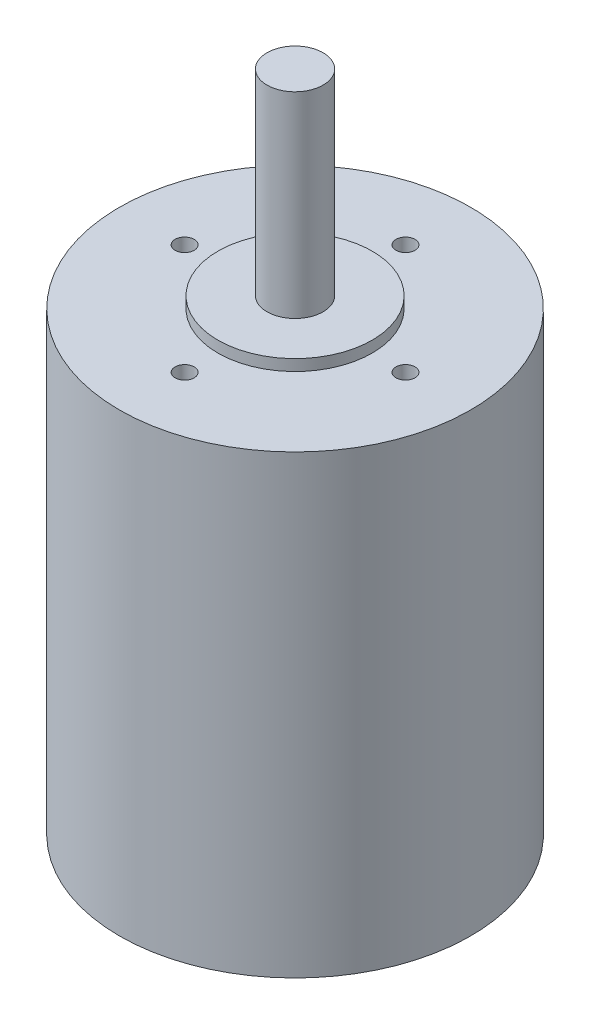
ISO-10303-21;
HEADER;
FILE_DESCRIPTION(('STEP AP214'),'2;1');
FILE_NAME('part.step','',(''),(''),'','','');
FILE_SCHEMA(('AUTOMOTIVE_DESIGN { 1 0 10303 214 1 1 1 1 }'));
ENDSEC;
DATA;
#1=APPLICATION_CONTEXT('core data for automotive mechanical design processes');
#2=APPLICATION_PROTOCOL_DEFINITION('international standard','automotive_design',2000,#1);
#3=PRODUCT_CONTEXT('',#1,'mechanical');
#4=PRODUCT('Part','Part','',(#3));
#5=PRODUCT_RELATED_PRODUCT_CATEGORY('part','',(#4));
#6=PRODUCT_DEFINITION_FORMATION('','',#4);
#7=PRODUCT_DEFINITION_CONTEXT('part definition',#1,'design');
#8=PRODUCT_DEFINITION('design','',#6,#7);
#9=PRODUCT_DEFINITION_SHAPE('','',#8);
#10=(LENGTH_UNIT() NAMED_UNIT(*) SI_UNIT(.MILLI.,.METRE.));
#11=(NAMED_UNIT(*) PLANE_ANGLE_UNIT() SI_UNIT($,.RADIAN.));
#12=(NAMED_UNIT(*) SI_UNIT($,.STERADIAN.) SOLID_ANGLE_UNIT());
#13=UNCERTAINTY_MEASURE_WITH_UNIT(LENGTH_MEASURE(1.E-05),#10,'distance_accuracy_value','');
#14=(GEOMETRIC_REPRESENTATION_CONTEXT(3) GLOBAL_UNCERTAINTY_ASSIGNED_CONTEXT((#13)) GLOBAL_UNIT_ASSIGNED_CONTEXT((#10,
#11,#12)) REPRESENTATION_CONTEXT('',''));
#15=CARTESIAN_POINT('',(0.,0.,0.));
#16=DIRECTION('',(0.,0.,1.));
#17=DIRECTION('',(1.,0.,0.));
#18=AXIS2_PLACEMENT_3D('',#15,#16,#17);
#19=CARTESIAN_POINT('',(0.,105.664,0.));
#20=DIRECTION('',(0.,1.,0.));
#21=DIRECTION('',(0.,0.,1.));
#22=AXIS2_PLACEMENT_3D('',#19,#20,#21);
#23=PLANE('',#22);
#24=CARTESIAN_POINT('',(0.,105.664,0.));
#25=DIRECTION('',(0.,1.,0.));
#26=DIRECTION('',(0.,0.,1.));
#27=AXIS2_PLACEMENT_3D('',#24,#25,#26);
#28=CIRCLE('',#27,17.4625);
#29=CARTESIAN_POINT('',(0.,105.664,17.4625));
#30=VERTEX_POINT('',#29);
#31=EDGE_CURVE('E42',#30,#30,#28,.T.);
#32=ORIENTED_EDGE('',*,*,#31,.T.);
#33=EDGE_LOOP('',(#32));
#34=FACE_BOUND('',#33,.T.);
#35=CARTESIAN_POINT('',(0.,105.664,0.));
#36=DIRECTION('',(0.,1.,0.));
#37=DIRECTION('',(0.,0.,1.));
#38=AXIS2_PLACEMENT_3D('',#35,#36,#37);
#39=CIRCLE('',#38,6.35);
#40=CARTESIAN_POINT('',(0.,105.664,6.35));
#41=VERTEX_POINT('',#40);
#42=EDGE_CURVE('E50',#41,#41,#39,.T.);
#43=ORIENTED_EDGE('',*,*,#42,.F.);
#44=EDGE_LOOP('',(#43));
#45=FACE_BOUND('',#44,.T.);
#46=ADVANCED_FACE('F31',(#34,#45),#23,.T.);
#47=CARTESIAN_POINT('',(0.,103.124,0.));
#48=DIRECTION('',(0.,1.,0.));
#49=DIRECTION('',(0.,0.,1.));
#50=AXIS2_PLACEMENT_3D('',#47,#48,#49);
#51=PLANE('',#50);
#52=CARTESIAN_POINT('',(-25.,103.124,0.));
#53=DIRECTION('',(0.,1.,0.));
#54=DIRECTION('',(0.,0.,1.));
#55=AXIS2_PLACEMENT_3D('',#52,#53,#54);
#56=CIRCLE('',#55,2.159);
#57=CARTESIAN_POINT('',(-25.,103.124,2.159));
#58=VERTEX_POINT('',#57);
#59=EDGE_CURVE('E74',#58,#58,#56,.T.);
#60=ORIENTED_EDGE('',*,*,#59,.F.);
#61=EDGE_LOOP('',(#60));
#62=FACE_BOUND('',#61,.T.);
#63=CARTESIAN_POINT('',(0.,103.124,25.));
#64=DIRECTION('',(0.,1.,0.));
#65=DIRECTION('',(0.,0.,1.));
#66=AXIS2_PLACEMENT_3D('',#63,#64,#65);
#67=CIRCLE('',#66,2.159);
#68=CARTESIAN_POINT('',(0.,103.124,27.159));
#69=VERTEX_POINT('',#68);
#70=EDGE_CURVE('E68',#69,#69,#67,.T.);
#71=ORIENTED_EDGE('',*,*,#70,.F.);
#72=EDGE_LOOP('',(#71));
#73=FACE_BOUND('',#72,.T.);
#74=CARTESIAN_POINT('',(25.,103.124,0.));
#75=DIRECTION('',(0.,1.,0.));
#76=DIRECTION('',(0.,0.,1.));
#77=AXIS2_PLACEMENT_3D('',#74,#75,#76);
#78=CIRCLE('',#77,2.159);
#79=CARTESIAN_POINT('',(25.,103.124,2.159));
#80=VERTEX_POINT('',#79);
#81=EDGE_CURVE('E62',#80,#80,#78,.T.);
#82=ORIENTED_EDGE('',*,*,#81,.F.);
#83=EDGE_LOOP('',(#82));
#84=FACE_BOUND('',#83,.T.);
#85=CARTESIAN_POINT('',(0.,103.124,-25.));
#86=DIRECTION('',(0.,1.,0.));
#87=DIRECTION('',(0.,0.,1.));
#88=AXIS2_PLACEMENT_3D('',#85,#86,#87);
#89=CIRCLE('',#88,2.159);
#90=CARTESIAN_POINT('',(0.,103.124,-22.841));
#91=VERTEX_POINT('',#90);
#92=EDGE_CURVE('E56',#91,#91,#89,.T.);
#93=ORIENTED_EDGE('',*,*,#92,.F.);
#94=EDGE_LOOP('',(#93));
#95=FACE_BOUND('',#94,.T.);
#96=CARTESIAN_POINT('',(0.,103.124,0.));
#97=DIRECTION('',(0.,1.,0.));
#98=DIRECTION('',(0.,0.,1.));
#99=AXIS2_PLACEMENT_3D('',#96,#97,#98);
#100=CIRCLE('',#99,39.751);
#101=CARTESIAN_POINT('',(0.,103.124,39.751));
#102=VERTEX_POINT('',#101);
#103=EDGE_CURVE('E10',#102,#102,#100,.T.);
#104=ORIENTED_EDGE('',*,*,#103,.T.);
#105=EDGE_LOOP('',(#104));
#106=FACE_BOUND('',#105,.T.);
#107=CARTESIAN_POINT('',(0.,103.124,0.));
#108=DIRECTION('',(0.,1.,0.));
#109=DIRECTION('',(0.,0.,1.));
#110=AXIS2_PLACEMENT_3D('',#107,#108,#109);
#111=CIRCLE('',#110,17.4625);
#112=CARTESIAN_POINT('',(0.,103.124,17.4625));
#113=VERTEX_POINT('',#112);
#114=EDGE_CURVE('E44',#113,#113,#111,.T.);
#115=ORIENTED_EDGE('',*,*,#114,.F.);
#116=EDGE_LOOP('',(#115));
#117=FACE_BOUND('',#116,.T.);
#118=ADVANCED_FACE('F89',(#62,#73,#84,#95,#106,#117),#51,.T.);
#119=CARTESIAN_POINT('',(0.,103.124,0.));
#120=DIRECTION('',(0.,-1.,0.));
#121=DIRECTION('',(0.,0.,-1.));
#122=AXIS2_PLACEMENT_3D('',#119,#120,#121);
#123=CYLINDRICAL_SURFACE('',#122,39.751);
#124=ORIENTED_EDGE('',*,*,#103,.F.);
#125=EDGE_LOOP('',(#124));
#126=FACE_BOUND('',#125,.T.);
#127=CARTESIAN_POINT('',(0.,0.,0.));
#128=DIRECTION('',(0.,1.,0.));
#129=DIRECTION('',(0.,0.,1.));
#130=AXIS2_PLACEMENT_3D('',#127,#128,#129);
#131=CIRCLE('',#130,39.751);
#132=CARTESIAN_POINT('',(0.,0.,39.751));
#133=VERTEX_POINT('',#132);
#134=EDGE_CURVE('E35',#133,#133,#131,.T.);
#135=ORIENTED_EDGE('',*,*,#134,.T.);
#136=EDGE_LOOP('',(#135));
#137=FACE_BOUND('',#136,.T.);
#138=ADVANCED_FACE('F33',(#126,#137),#123,.T.);
#139=CARTESIAN_POINT('',(0.,0.,0.));
#140=DIRECTION('',(0.,1.,0.));
#141=DIRECTION('',(0.,0.,1.));
#142=AXIS2_PLACEMENT_3D('',#139,#140,#141);
#143=PLANE('',#142);
#144=ORIENTED_EDGE('',*,*,#134,.F.);
#145=EDGE_LOOP('',(#144));
#146=FACE_BOUND('',#145,.T.);
#147=ADVANCED_FACE('F104',(#146),#143,.F.);
#148=CARTESIAN_POINT('',(0.,105.664,0.));
#149=DIRECTION('',(0.,-1.,0.));
#150=DIRECTION('',(0.,0.,-1.));
#151=AXIS2_PLACEMENT_3D('',#148,#149,#150);
#152=CYLINDRICAL_SURFACE('',#151,17.4625);
#153=ORIENTED_EDGE('',*,*,#31,.F.);
#154=EDGE_LOOP('',(#153));
#155=FACE_BOUND('',#154,.T.);
#156=ORIENTED_EDGE('',*,*,#114,.T.);
#157=EDGE_LOOP('',(#156));
#158=FACE_BOUND('',#157,.T.);
#159=ADVANCED_FACE('F101',(#155,#158),#152,.T.);
#160=CARTESIAN_POINT('',(0.,150.114,0.));
#161=DIRECTION('',(0.,-1.,0.));
#162=DIRECTION('',(0.,0.,-1.));
#163=AXIS2_PLACEMENT_3D('',#160,#161,#162);
#164=CYLINDRICAL_SURFACE('',#163,6.35);
#165=CARTESIAN_POINT('',(0.,150.114,0.));
#166=DIRECTION('',(0.,1.,0.));
#167=DIRECTION('',(0.,0.,1.));
#168=AXIS2_PLACEMENT_3D('',#165,#166,#167);
#169=CIRCLE('',#168,6.35);
#170=CARTESIAN_POINT('',(0.,150.114,6.35));
#171=VERTEX_POINT('',#170);
#172=EDGE_CURVE('E47',#171,#171,#169,.T.);
#173=ORIENTED_EDGE('',*,*,#172,.F.);
#174=EDGE_LOOP('',(#173));
#175=FACE_BOUND('',#174,.T.);
#176=ORIENTED_EDGE('',*,*,#42,.T.);
#177=EDGE_LOOP('',(#176));
#178=FACE_BOUND('',#177,.T.);
#179=ADVANCED_FACE('F103',(#175,#178),#164,.T.);
#180=CARTESIAN_POINT('',(0.,150.114,0.));
#181=DIRECTION('',(0.,1.,0.));
#182=DIRECTION('',(0.,0.,1.));
#183=AXIS2_PLACEMENT_3D('',#180,#181,#182);
#184=PLANE('',#183);
#185=ORIENTED_EDGE('',*,*,#172,.T.);
#186=EDGE_LOOP('',(#185));
#187=FACE_BOUND('',#186,.T.);
#188=ADVANCED_FACE('F111',(#187),#184,.T.);
#189=CARTESIAN_POINT('',(0.,58.674,-25.));
#190=DIRECTION('',(0.,1.,0.));
#191=DIRECTION('',(0.,0.,1.));
#192=AXIS2_PLACEMENT_3D('',#189,#190,#191);
#193=CYLINDRICAL_SURFACE('',#192,2.159);
#194=CARTESIAN_POINT('',(0.,58.674,-25.));
#195=DIRECTION('',(0.,1.,0.));
#196=DIRECTION('',(0.,0.,1.));
#197=AXIS2_PLACEMENT_3D('',#194,#195,#196);
#198=CIRCLE('',#197,2.159);
#199=CARTESIAN_POINT('',(0.,58.674,-22.841));
#200=VERTEX_POINT('',#199);
#201=EDGE_CURVE('E53',#200,#200,#198,.T.);
#202=ORIENTED_EDGE('',*,*,#201,.F.);
#203=EDGE_LOOP('',(#202));
#204=FACE_BOUND('',#203,.T.);
#205=ORIENTED_EDGE('',*,*,#92,.T.);
#206=EDGE_LOOP('',(#205));
#207=FACE_BOUND('',#206,.T.);
#208=ADVANCED_FACE('F125',(#204,#207),#193,.F.);
#209=CARTESIAN_POINT('',(0.,58.674,-25.));
#210=DIRECTION('',(0.,1.,0.));
#211=DIRECTION('',(0.,0.,1.));
#212=AXIS2_PLACEMENT_3D('',#209,#210,#211);
#213=PLANE('',#212);
#214=ORIENTED_EDGE('',*,*,#201,.T.);
#215=EDGE_LOOP('',(#214));
#216=FACE_BOUND('',#215,.T.);
#217=ADVANCED_FACE('F129',(#216),#213,.T.);
#218=CARTESIAN_POINT('',(25.,58.674,0.));
#219=DIRECTION('',(0.,1.,0.));
#220=DIRECTION('',(0.,0.,1.));
#221=AXIS2_PLACEMENT_3D('',#218,#219,#220);
#222=CYLINDRICAL_SURFACE('',#221,2.159);
#223=CARTESIAN_POINT('',(25.,58.674,0.));
#224=DIRECTION('',(0.,1.,0.));
#225=DIRECTION('',(0.,0.,1.));
#226=AXIS2_PLACEMENT_3D('',#223,#224,#225);
#227=CIRCLE('',#226,2.159);
#228=CARTESIAN_POINT('',(25.,58.674,2.159));
#229=VERTEX_POINT('',#228);
#230=EDGE_CURVE('E59',#229,#229,#227,.T.);
#231=ORIENTED_EDGE('',*,*,#230,.F.);
#232=EDGE_LOOP('',(#231));
#233=FACE_BOUND('',#232,.T.);
#234=ORIENTED_EDGE('',*,*,#81,.T.);
#235=EDGE_LOOP('',(#234));
#236=FACE_BOUND('',#235,.T.);
#237=ADVANCED_FACE('F133',(#233,#236),#222,.F.);
#238=CARTESIAN_POINT('',(25.,58.674,0.));
#239=DIRECTION('',(0.,1.,0.));
#240=DIRECTION('',(0.,0.,1.));
#241=AXIS2_PLACEMENT_3D('',#238,#239,#240);
#242=PLANE('',#241);
#243=ORIENTED_EDGE('',*,*,#230,.T.);
#244=EDGE_LOOP('',(#243));
#245=FACE_BOUND('',#244,.T.);
#246=ADVANCED_FACE('F137',(#245),#242,.T.);
#247=CARTESIAN_POINT('',(0.,58.674,25.));
#248=DIRECTION('',(0.,1.,0.));
#249=DIRECTION('',(0.,0.,1.));
#250=AXIS2_PLACEMENT_3D('',#247,#248,#249);
#251=CYLINDRICAL_SURFACE('',#250,2.159);
#252=CARTESIAN_POINT('',(0.,58.674,25.));
#253=DIRECTION('',(0.,1.,0.));
#254=DIRECTION('',(0.,0.,1.));
#255=AXIS2_PLACEMENT_3D('',#252,#253,#254);
#256=CIRCLE('',#255,2.159);
#257=CARTESIAN_POINT('',(0.,58.674,27.159));
#258=VERTEX_POINT('',#257);
#259=EDGE_CURVE('E65',#258,#258,#256,.T.);
#260=ORIENTED_EDGE('',*,*,#259,.F.);
#261=EDGE_LOOP('',(#260));
#262=FACE_BOUND('',#261,.T.);
#263=ORIENTED_EDGE('',*,*,#70,.T.);
#264=EDGE_LOOP('',(#263));
#265=FACE_BOUND('',#264,.T.);
#266=ADVANCED_FACE('F141',(#262,#265),#251,.F.);
#267=CARTESIAN_POINT('',(0.,58.674,25.));
#268=DIRECTION('',(0.,1.,0.));
#269=DIRECTION('',(0.,0.,1.));
#270=AXIS2_PLACEMENT_3D('',#267,#268,#269);
#271=PLANE('',#270);
#272=ORIENTED_EDGE('',*,*,#259,.T.);
#273=EDGE_LOOP('',(#272));
#274=FACE_BOUND('',#273,.T.);
#275=ADVANCED_FACE('F85',(#274),#271,.T.);
#276=CARTESIAN_POINT('',(-25.,58.674,0.));
#277=DIRECTION('',(0.,1.,0.));
#278=DIRECTION('',(0.,0.,1.));
#279=AXIS2_PLACEMENT_3D('',#276,#277,#278);
#280=CYLINDRICAL_SURFACE('',#279,2.159);
#281=CARTESIAN_POINT('',(-25.,58.674,0.));
#282=DIRECTION('',(0.,1.,0.));
#283=DIRECTION('',(0.,0.,1.));
#284=AXIS2_PLACEMENT_3D('',#281,#282,#283);
#285=CIRCLE('',#284,2.159);
#286=CARTESIAN_POINT('',(-25.,58.674,2.159));
#287=VERTEX_POINT('',#286);
#288=EDGE_CURVE('E71',#287,#287,#285,.T.);
#289=ORIENTED_EDGE('',*,*,#288,.F.);
#290=EDGE_LOOP('',(#289));
#291=FACE_BOUND('',#290,.T.);
#292=ORIENTED_EDGE('',*,*,#59,.T.);
#293=EDGE_LOOP('',(#292));
#294=FACE_BOUND('',#293,.T.);
#295=ADVANCED_FACE('F82',(#291,#294),#280,.F.);
#296=CARTESIAN_POINT('',(-25.,58.674,0.));
#297=DIRECTION('',(0.,1.,0.));
#298=DIRECTION('',(0.,0.,1.));
#299=AXIS2_PLACEMENT_3D('',#296,#297,#298);
#300=PLANE('',#299);
#301=ORIENTED_EDGE('',*,*,#288,.T.);
#302=EDGE_LOOP('',(#301));
#303=FACE_BOUND('',#302,.T.);
#304=ADVANCED_FACE('F80',(#303),#300,.T.);
#305=CLOSED_SHELL('',(#46,#118,#138,#147,#159,#179,#188,#208,#217,#237,#246,#266,#275,#295,#304));
#306=MANIFOLD_SOLID_BREP('B2',#305);
#307=ADVANCED_BREP_SHAPE_REPRESENTATION('',(#18,#306),#14);
#308=SHAPE_DEFINITION_REPRESENTATION(#9,#307);
ENDSEC;
END-ISO-10303-21;
